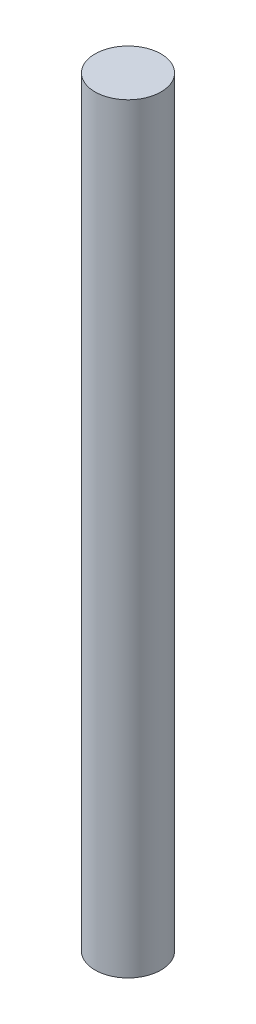
ISO-10303-21;
HEADER;
FILE_DESCRIPTION(('STEP AP214'),'2;1');
FILE_NAME('part.step','',(''),(''),'','','');
FILE_SCHEMA(('AUTOMOTIVE_DESIGN { 1 0 10303 214 1 1 1 1 }'));
ENDSEC;
DATA;
#1=APPLICATION_CONTEXT('core data for automotive mechanical design processes');
#2=APPLICATION_PROTOCOL_DEFINITION('international standard','automotive_design',2000,#1);
#3=PRODUCT_CONTEXT('',#1,'mechanical');
#4=PRODUCT('Part','Part','',(#3));
#5=PRODUCT_RELATED_PRODUCT_CATEGORY('part','',(#4));
#6=PRODUCT_DEFINITION_FORMATION('','',#4);
#7=PRODUCT_DEFINITION_CONTEXT('part definition',#1,'design');
#8=PRODUCT_DEFINITION('design','',#6,#7);
#9=PRODUCT_DEFINITION_SHAPE('','',#8);
#10=(LENGTH_UNIT() NAMED_UNIT(*) SI_UNIT(.MILLI.,.METRE.));
#11=(NAMED_UNIT(*) PLANE_ANGLE_UNIT() SI_UNIT($,.RADIAN.));
#12=(NAMED_UNIT(*) SI_UNIT($,.STERADIAN.) SOLID_ANGLE_UNIT());
#13=UNCERTAINTY_MEASURE_WITH_UNIT(LENGTH_MEASURE(1.E-05),#10,'distance_accuracy_value','');
#14=(GEOMETRIC_REPRESENTATION_CONTEXT(3) GLOBAL_UNCERTAINTY_ASSIGNED_CONTEXT((#13)) GLOBAL_UNIT_ASSIGNED_CONTEXT((#10,
#11,#12)) REPRESENTATION_CONTEXT('',''));
#15=CARTESIAN_POINT('',(0.,0.,0.));
#16=DIRECTION('',(0.,0.,1.));
#17=DIRECTION('',(1.,0.,0.));
#18=AXIS2_PLACEMENT_3D('',#15,#16,#17);
#19=CARTESIAN_POINT('',(44.2000000837792,222.01741699797,-149.6509997169));
#20=DIRECTION('',(0.,-1.,0.));
#21=DIRECTION('',(0.,0.,-1.));
#22=AXIS2_PLACEMENT_3D('',#19,#20,#21);
#23=CYLINDRICAL_SURFACE('',#22,8.00000000000001);
#24=CARTESIAN_POINT('',(44.2000000837792,14.859,-149.6509997169));
#25=DIRECTION('',(0.,1.,0.));
#26=DIRECTION('',(0.,0.,1.));
#27=AXIS2_PLACEMENT_3D('',#24,#25,#26);
#28=CIRCLE('',#27,8.00000000000001);
#29=CARTESIAN_POINT('',(44.2000000837792,14.859,-157.6509997169));
#30=VERTEX_POINT('',#29);
#31=EDGE_CURVE('E37',#30,#30,#28,.T.);
#32=CARTESIAN_POINT('',(44.2000000837792,199.39,-149.6509997169));
#33=DIRECTION('',(0.,1.,0.));
#34=DIRECTION('',(0.,0.,1.));
#35=AXIS2_PLACEMENT_3D('',#32,#33,#34);
#36=CIRCLE('',#35,8.00000000000001);
#37=CARTESIAN_POINT('',(44.2000000837792,199.39,-157.6509997169));
#38=VERTEX_POINT('',#37);
#39=EDGE_CURVE('E10',#38,#38,#36,.T.);
#40=CARTESIAN_POINT('',(44.2000000837792,14.859,-157.6509997169));
#41=CARTESIAN_POINT('',(44.2000000837792,16.7811979166666,-157.6509997169));
#42=CARTESIAN_POINT('',(44.2000000837792,18.7033958333333,-157.6509997169));
#43=CARTESIAN_POINT('',(44.2000000837792,22.5477916666666,-157.6509997169));
#44=CARTESIAN_POINT('',(44.2000000837792,24.4699895833333,-157.6509997169));
#45=CARTESIAN_POINT('',(44.2000000837792,28.3143854166666,-157.6509997169));
#46=CARTESIAN_POINT('',(44.2000000837792,30.2365833333333,-157.6509997169));
#47=CARTESIAN_POINT('',(44.2000000837792,34.0809791666667,-157.6509997169));
#48=CARTESIAN_POINT('',(44.2000000837792,36.0031770833333,-157.6509997169));
#49=CARTESIAN_POINT('',(44.2000000837792,39.8475729166666,-157.6509997169));
#50=CARTESIAN_POINT('',(44.2000000837792,41.7697708333333,-157.6509997169));
#51=CARTESIAN_POINT('',(44.2000000837792,45.6141666666666,-157.6509997169));
#52=CARTESIAN_POINT('',(44.2000000837792,47.5363645833333,-157.6509997169));
#53=CARTESIAN_POINT('',(44.2000000837792,51.3807604166666,-157.6509997169));
#54=CARTESIAN_POINT('',(44.2000000837792,53.3029583333333,-157.6509997169));
#55=CARTESIAN_POINT('',(44.2000000837792,57.1473541666667,-157.6509997169));
#56=CARTESIAN_POINT('',(44.2000000837792,59.0695520833333,-157.6509997169));
#57=CARTESIAN_POINT('',(44.2000000837792,62.9139479166666,-157.6509997169));
#58=CARTESIAN_POINT('',(44.2000000837792,64.8361458333333,-157.6509997169));
#59=CARTESIAN_POINT('',(44.2000000837792,68.6805416666666,-157.6509997169));
#60=CARTESIAN_POINT('',(44.2000000837792,70.6027395833333,-157.6509997169));
#61=CARTESIAN_POINT('',(44.2000000837792,74.4471354166666,-157.6509997169));
#62=CARTESIAN_POINT('',(44.2000000837792,76.3693333333333,-157.6509997169));
#63=CARTESIAN_POINT('',(44.2000000837792,80.2137291666666,-157.6509997169));
#64=CARTESIAN_POINT('',(44.2000000837792,82.1359270833333,-157.6509997169));
#65=CARTESIAN_POINT('',(44.2000000837792,85.9803229166666,-157.6509997169));
#66=CARTESIAN_POINT('',(44.2000000837792,87.9025208333333,-157.6509997169));
#67=CARTESIAN_POINT('',(44.2000000837792,91.7469166666666,-157.6509997169));
#68=CARTESIAN_POINT('',(44.2000000837792,93.6691145833333,-157.6509997169));
#69=CARTESIAN_POINT('',(44.2000000837792,97.5135104166666,-157.6509997169));
#70=CARTESIAN_POINT('',(44.2000000837792,99.4357083333333,-157.6509997169));
#71=CARTESIAN_POINT('',(44.2000000837792,103.280104166667,-157.6509997169));
#72=CARTESIAN_POINT('',(44.2000000837792,105.202302083333,-157.6509997169));
#73=CARTESIAN_POINT('',(44.2000000837792,109.046697916667,-157.6509997169));
#74=CARTESIAN_POINT('',(44.2000000837792,110.968895833333,-157.6509997169));
#75=CARTESIAN_POINT('',(44.2000000837792,114.813291666667,-157.6509997169));
#76=CARTESIAN_POINT('',(44.2000000837792,116.735489583333,-157.6509997169));
#77=CARTESIAN_POINT('',(44.2000000837792,120.579885416667,-157.6509997169));
#78=CARTESIAN_POINT('',(44.2000000837792,122.502083333333,-157.6509997169));
#79=CARTESIAN_POINT('',(44.2000000837792,126.346479166667,-157.6509997169));
#80=CARTESIAN_POINT('',(44.2000000837792,128.268677083333,-157.6509997169));
#81=CARTESIAN_POINT('',(44.2000000837792,132.113072916667,-157.6509997169));
#82=CARTESIAN_POINT('',(44.2000000837792,134.035270833333,-157.6509997169));
#83=CARTESIAN_POINT('',(44.2000000837792,137.879666666667,-157.6509997169));
#84=CARTESIAN_POINT('',(44.2000000837792,139.801864583333,-157.6509997169));
#85=CARTESIAN_POINT('',(44.2000000837792,143.646260416667,-157.6509997169));
#86=CARTESIAN_POINT('',(44.2000000837792,145.568458333333,-157.6509997169));
#87=CARTESIAN_POINT('',(44.2000000837792,149.412854166667,-157.6509997169));
#88=CARTESIAN_POINT('',(44.2000000837792,151.335052083333,-157.6509997169));
#89=CARTESIAN_POINT('',(44.2000000837792,155.179447916667,-157.6509997169));
#90=CARTESIAN_POINT('',(44.2000000837792,157.101645833333,-157.6509997169));
#91=CARTESIAN_POINT('',(44.2000000837792,160.946041666667,-157.6509997169));
#92=CARTESIAN_POINT('',(44.2000000837792,162.868239583333,-157.6509997169));
#93=CARTESIAN_POINT('',(44.2000000837792,166.712635416667,-157.6509997169));
#94=CARTESIAN_POINT('',(44.2000000837792,168.634833333333,-157.6509997169));
#95=CARTESIAN_POINT('',(44.2000000837792,172.479229166667,-157.6509997169));
#96=CARTESIAN_POINT('',(44.2000000837792,174.401427083333,-157.6509997169));
#97=CARTESIAN_POINT('',(44.2000000837792,178.245822916667,-157.6509997169));
#98=CARTESIAN_POINT('',(44.2000000837792,180.168020833333,-157.6509997169));
#99=CARTESIAN_POINT('',(44.2000000837792,184.012416666667,-157.6509997169));
#100=CARTESIAN_POINT('',(44.2000000837792,185.934614583333,-157.6509997169));
#101=CARTESIAN_POINT('',(44.2000000837792,189.779010416667,-157.6509997169));
#102=CARTESIAN_POINT('',(44.2000000837792,191.701208333333,-157.6509997169));
#103=CARTESIAN_POINT('',(44.2000000837792,195.545604166667,-157.6509997169));
#104=CARTESIAN_POINT('',(44.2000000837792,197.467802083333,-157.6509997169));
#105=CARTESIAN_POINT('',(44.2000000837792,199.39,-157.6509997169));
#106=B_SPLINE_CURVE_WITH_KNOTS('',3,(#40,#41,#42,#43,#44,#45,#46,#47,#48,#49,#50,#51,#52,#53,
#54,#55,#56,#57,#58,#59,#60,#61,#62,#63,#64,#65,#66,#67,#68,#69,#70,#71,#72,#73,#74,#75,#76,#77,
#78,#79,#80,#81,#82,#83,#84,#85,#86,#87,#88,#89,#90,#91,#92,#93,#94,#95,#96,#97,#98,#99,#100,
#101,#102,#103,#104,#105),.UNSPECIFIED.,.F.,.F.,(4,2,2,2,2,2,2,2,2,2,2,2,2,2,2,2,2,2,2,2,2,2,2,
2,2,2,2,2,2,2,2,2,4),(0.,5.76659374999999,11.5331875,17.29978125,23.066375,28.83296875,
34.5995625,40.36615625,46.13275,51.89934375,57.6659375,63.43253125,69.199125,74.96571875,
80.7323125,86.49890625,92.2655,98.03209375,103.7986875,109.56528125,115.331875,121.09846875,
126.8650625,132.63165625,138.39825,144.16484375,149.9314375,155.69803125,161.464625,
167.23121875,172.9978125,178.76440625,184.531),.UNSPECIFIED.);
#107=EDGE_CURVE('BSEAM30',#30,#38,#106,.T.);
#108=ORIENTED_EDGE('',*,*,#31,.T.);
#109=ORIENTED_EDGE('',*,*,#39,.F.);
#110=ORIENTED_EDGE('',*,*,#107,.T.);
#111=ORIENTED_EDGE('',*,*,#107,.F.);
#112=EDGE_LOOP('',(#108,#110,#109,#111));
#113=FACE_BOUND('',#112,.T.);
#114=ADVANCED_FACE('F30',(#113),#23,.T.);
#115=CARTESIAN_POINT('',(44.2000000837792,14.859,-149.6509997169));
#116=DIRECTION('',(0.,1.,0.));
#117=DIRECTION('',(0.,0.,1.));
#118=AXIS2_PLACEMENT_3D('',#115,#116,#117);
#119=PLANE('',#118);
#120=ORIENTED_EDGE('',*,*,#31,.F.);
#121=EDGE_LOOP('',(#120));
#122=FACE_BOUND('',#121,.T.);
#123=ADVANCED_FACE('F45',(#122),#119,.F.);
#124=CARTESIAN_POINT('',(48.2999984155873,199.39,-131.45099833481));
#125=DIRECTION('',(0.,1.,0.));
#126=DIRECTION('',(0.,0.,1.));
#127=AXIS2_PLACEMENT_3D('',#124,#125,#126);
#128=PLANE('',#127);
#129=ORIENTED_EDGE('',*,*,#39,.T.);
#130=EDGE_LOOP('',(#129));
#131=FACE_BOUND('',#130,.T.);
#132=ADVANCED_FACE('F32',(#131),#128,.T.);
#133=CLOSED_SHELL('',(#114,#123,#132));
#134=MANIFOLD_SOLID_BREP('B2',#133);
#135=ADVANCED_BREP_SHAPE_REPRESENTATION('',(#18,#134),#14);
#136=SHAPE_DEFINITION_REPRESENTATION(#9,#135);
ENDSEC;
END-ISO-10303-21;
